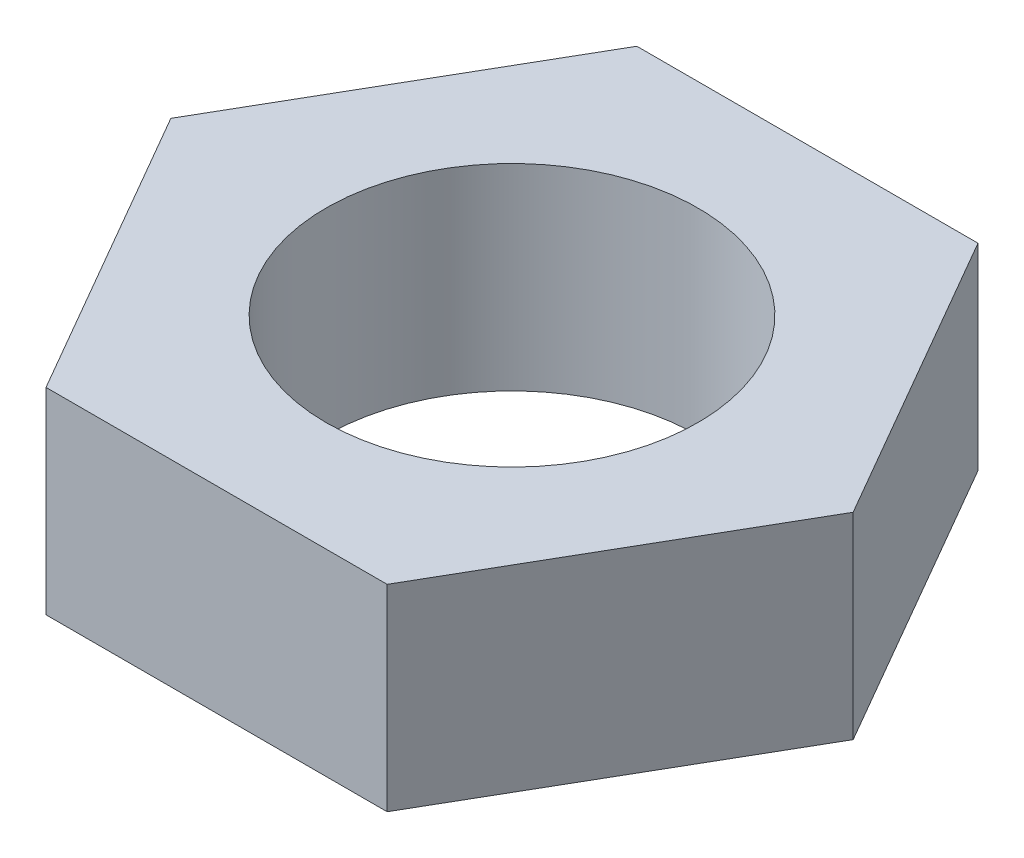
ISO-10303-21;
HEADER;
FILE_DESCRIPTION(('STEP AP214'),'2;1');
FILE_NAME('part.step','',(''),(''),'','','');
FILE_SCHEMA(('AUTOMOTIVE_DESIGN { 1 0 10303 214 1 1 1 1 }'));
ENDSEC;
DATA;
#1=APPLICATION_CONTEXT('core data for automotive mechanical design processes');
#2=APPLICATION_PROTOCOL_DEFINITION('international standard','automotive_design',2000,#1);
#3=PRODUCT_CONTEXT('',#1,'mechanical');
#4=PRODUCT('Part','Part','',(#3));
#5=PRODUCT_RELATED_PRODUCT_CATEGORY('part','',(#4));
#6=PRODUCT_DEFINITION_FORMATION('','',#4);
#7=PRODUCT_DEFINITION_CONTEXT('part definition',#1,'design');
#8=PRODUCT_DEFINITION('design','',#6,#7);
#9=PRODUCT_DEFINITION_SHAPE('','',#8);
#10=(LENGTH_UNIT() NAMED_UNIT(*) SI_UNIT(.MILLI.,.METRE.));
#11=(NAMED_UNIT(*) PLANE_ANGLE_UNIT() SI_UNIT($,.RADIAN.));
#12=(NAMED_UNIT(*) SI_UNIT($,.STERADIAN.) SOLID_ANGLE_UNIT());
#13=UNCERTAINTY_MEASURE_WITH_UNIT(LENGTH_MEASURE(1.E-05),#10,'distance_accuracy_value','');
#14=(GEOMETRIC_REPRESENTATION_CONTEXT(3) GLOBAL_UNCERTAINTY_ASSIGNED_CONTEXT((#13)) GLOBAL_UNIT_ASSIGNED_CONTEXT((#10,
#11,#12)) REPRESENTATION_CONTEXT('',''));
#15=CARTESIAN_POINT('',(0.,0.,0.));
#16=DIRECTION('',(0.,0.,1.));
#17=DIRECTION('',(1.,0.,0.));
#18=AXIS2_PLACEMENT_3D('',#15,#16,#17);
#19=CARTESIAN_POINT('',(1.37481532850781,1.5875,-2.38124999999999));
#20=DIRECTION('',(0.,1.,0.));
#21=DIRECTION('',(0.,0.,1.));
#22=AXIS2_PLACEMENT_3D('',#19,#20,#21);
#23=PLANE('',#22);
#24=DIRECTION('',(-0.499999999999999,0.,-0.866025403784439));
#25=VECTOR('',#24,1.);
#26=CARTESIAN_POINT('',(2.7496306570156,1.5875,0.));
#27=LINE('',#26,#25);
#28=CARTESIAN_POINT('',(2.7496306570156,1.5875,0.));
#29=VERTEX_POINT('',#28);
#30=CARTESIAN_POINT('',(1.37481532850781,1.5875,-2.38124999999999));
#31=VERTEX_POINT('',#30);
#32=EDGE_CURVE('E126',#29,#31,#27,.T.);
#33=ORIENTED_EDGE('',*,*,#32,.T.);
#34=DIRECTION('',(-1.,0.,0.));
#35=VECTOR('',#34,1.);
#36=CARTESIAN_POINT('',(1.37481532850781,1.5875,-2.38124999999999));
#37=LINE('',#36,#35);
#38=CARTESIAN_POINT('',(-1.3748153285078,1.5875,-2.38124999999999));
#39=VERTEX_POINT('',#38);
#40=EDGE_CURVE('E84',#31,#39,#37,.T.);
#41=ORIENTED_EDGE('',*,*,#40,.T.);
#42=DIRECTION('',(-0.5,0.,0.866025403784438));
#43=VECTOR('',#42,1.);
#44=CARTESIAN_POINT('',(-1.3748153285078,1.5875,-2.38124999999999));
#45=LINE('',#44,#43);
#46=CARTESIAN_POINT('',(-2.74963065701559,1.5875,0.));
#47=VERTEX_POINT('',#46);
#48=EDGE_CURVE('E97',#39,#47,#45,.T.);
#49=ORIENTED_EDGE('',*,*,#48,.T.);
#50=DIRECTION('',(0.500000000000001,0.,0.866025403784438));
#51=VECTOR('',#50,1.);
#52=CARTESIAN_POINT('',(-2.74963065701559,1.5875,0.));
#53=LINE('',#52,#51);
#54=CARTESIAN_POINT('',(-1.37481532850779,1.5875,2.38125000000001));
#55=VERTEX_POINT('',#54);
#56=EDGE_CURVE('E91',#47,#55,#53,.T.);
#57=ORIENTED_EDGE('',*,*,#56,.T.);
#58=DIRECTION('',(1.,0.,0.));
#59=VECTOR('',#58,1.);
#60=CARTESIAN_POINT('',(-1.37481532850779,1.5875,2.38125000000001));
#61=LINE('',#60,#59);
#62=CARTESIAN_POINT('',(1.37481532850779,1.5875,2.38125000000001));
#63=VERTEX_POINT('',#62);
#64=EDGE_CURVE('E95',#55,#63,#61,.T.);
#65=ORIENTED_EDGE('',*,*,#64,.T.);
#66=DIRECTION('',(0.500000000000001,0.,-0.866025403784438));
#67=VECTOR('',#66,1.);
#68=CARTESIAN_POINT('',(1.37481532850779,1.5875,2.38125000000001));
#69=LINE('',#68,#67);
#70=EDGE_CURVE('E47',#63,#29,#69,.T.);
#71=ORIENTED_EDGE('',*,*,#70,.T.);
#72=EDGE_LOOP('',(#33,#41,#49,#57,#65,#71));
#73=FACE_BOUND('',#72,.T.);
#74=CARTESIAN_POINT('',(0.,1.5875,0.));
#75=DIRECTION('',(0.,1.,0.));
#76=DIRECTION('',(0.,0.,1.));
#77=AXIS2_PLACEMENT_3D('',#74,#75,#76);
#78=CIRCLE('',#77,1.4986);
#79=CARTESIAN_POINT('',(0.,1.5875,1.4986));
#80=VERTEX_POINT('',#79);
#81=EDGE_CURVE('E119',#80,#80,#78,.T.);
#82=ORIENTED_EDGE('',*,*,#81,.F.);
#83=EDGE_LOOP('',(#82));
#84=FACE_BOUND('',#83,.T.);
#85=ADVANCED_FACE('F30',(#73,#84),#23,.T.);
#86=CARTESIAN_POINT('',(1.37481532850781,0.,-2.38124999999999));
#87=DIRECTION('',(0.,1.,0.));
#88=DIRECTION('',(0.,0.,1.));
#89=AXIS2_PLACEMENT_3D('',#86,#87,#88);
#90=PLANE('',#89);
#91=DIRECTION('',(-0.499999999999999,0.,-0.866025403784439));
#92=VECTOR('',#91,1.);
#93=CARTESIAN_POINT('',(2.7496306570156,0.,0.));
#94=LINE('',#93,#92);
#95=CARTESIAN_POINT('',(2.7496306570156,0.,0.));
#96=VERTEX_POINT('',#95);
#97=CARTESIAN_POINT('',(1.37481532850781,0.,-2.38124999999999));
#98=VERTEX_POINT('',#97);
#99=EDGE_CURVE('E115',#96,#98,#94,.T.);
#100=ORIENTED_EDGE('',*,*,#99,.F.);
#101=DIRECTION('',(0.500000000000001,0.,-0.866025403784438));
#102=VECTOR('',#101,1.);
#103=CARTESIAN_POINT('',(1.37481532850779,0.,2.38125000000001));
#104=LINE('',#103,#102);
#105=CARTESIAN_POINT('',(1.37481532850779,0.,2.38125000000001));
#106=VERTEX_POINT('',#105);
#107=EDGE_CURVE('E76',#106,#96,#104,.T.);
#108=ORIENTED_EDGE('',*,*,#107,.F.);
#109=DIRECTION('',(1.,0.,0.));
#110=VECTOR('',#109,1.);
#111=CARTESIAN_POINT('',(-1.37481532850779,0.,2.38125000000001));
#112=LINE('',#111,#110);
#113=CARTESIAN_POINT('',(-1.37481532850779,0.,2.38125000000001));
#114=VERTEX_POINT('',#113);
#115=EDGE_CURVE('E70',#114,#106,#112,.T.);
#116=ORIENTED_EDGE('',*,*,#115,.F.);
#117=DIRECTION('',(0.500000000000001,0.,0.866025403784438));
#118=VECTOR('',#117,1.);
#119=CARTESIAN_POINT('',(-2.74963065701559,0.,0.));
#120=LINE('',#119,#118);
#121=CARTESIAN_POINT('',(-2.74963065701559,0.,0.));
#122=VERTEX_POINT('',#121);
#123=EDGE_CURVE('E105',#122,#114,#120,.T.);
#124=ORIENTED_EDGE('',*,*,#123,.F.);
#125=DIRECTION('',(-0.5,0.,0.866025403784438));
#126=VECTOR('',#125,1.);
#127=CARTESIAN_POINT('',(-1.3748153285078,0.,-2.38124999999999));
#128=LINE('',#127,#126);
#129=CARTESIAN_POINT('',(-1.3748153285078,0.,-2.38124999999999));
#130=VERTEX_POINT('',#129);
#131=EDGE_CURVE('E121',#130,#122,#128,.T.);
#132=ORIENTED_EDGE('',*,*,#131,.F.);
#133=DIRECTION('',(-1.,0.,0.));
#134=VECTOR('',#133,1.);
#135=CARTESIAN_POINT('',(1.37481532850781,0.,-2.38124999999999));
#136=LINE('',#135,#134);
#137=EDGE_CURVE('E118',#98,#130,#136,.T.);
#138=ORIENTED_EDGE('',*,*,#137,.F.);
#139=EDGE_LOOP('',(#100,#108,#116,#124,#132,#138));
#140=FACE_BOUND('',#139,.T.);
#141=CARTESIAN_POINT('',(0.,0.,0.));
#142=DIRECTION('',(0.,1.,0.));
#143=DIRECTION('',(0.,0.,1.));
#144=AXIS2_PLACEMENT_3D('',#141,#142,#143);
#145=CIRCLE('',#144,1.4986);
#146=CARTESIAN_POINT('',(0.,0.,1.4986));
#147=VERTEX_POINT('',#146);
#148=EDGE_CURVE('E219',#147,#147,#145,.T.);
#149=ORIENTED_EDGE('',*,*,#148,.T.);
#150=EDGE_LOOP('',(#149));
#151=FACE_BOUND('',#150,.T.);
#152=ADVANCED_FACE('F135',(#140,#151),#90,.F.);
#153=CARTESIAN_POINT('',(2.7496306570156,1.5875,0.));
#154=DIRECTION('',(-0.866025403784439,0.,0.5));
#155=DIRECTION('',(0.499999999999999,0.,0.866025403784439));
#156=AXIS2_PLACEMENT_3D('',#153,#154,#155);
#157=PLANE('',#156);
#158=ORIENTED_EDGE('',*,*,#99,.T.);
#159=DIRECTION('',(0.,-1.,0.));
#160=VECTOR('',#159,1.);
#161=CARTESIAN_POINT('',(1.37481532850781,1.5875,-2.38124999999999));
#162=LINE('',#161,#160);
#163=EDGE_CURVE('E11',#31,#98,#162,.T.);
#164=ORIENTED_EDGE('',*,*,#163,.F.);
#165=ORIENTED_EDGE('',*,*,#32,.F.);
#166=DIRECTION('',(0.,-1.,0.));
#167=VECTOR('',#166,1.);
#168=CARTESIAN_POINT('',(2.7496306570156,1.5875,0.));
#169=LINE('',#168,#167);
#170=EDGE_CURVE('E111',#29,#96,#169,.T.);
#171=ORIENTED_EDGE('',*,*,#170,.T.);
#172=EDGE_LOOP('',(#158,#164,#165,#171));
#173=FACE_BOUND('',#172,.T.);
#174=ADVANCED_FACE('F32',(#173),#157,.F.);
#175=CARTESIAN_POINT('',(1.37481532850781,1.5875,-2.38124999999999));
#176=DIRECTION('',(0.,0.,1.));
#177=DIRECTION('',(1.,0.,0.));
#178=AXIS2_PLACEMENT_3D('',#175,#176,#177);
#179=PLANE('',#178);
#180=ORIENTED_EDGE('',*,*,#137,.T.);
#181=DIRECTION('',(0.,-1.,0.));
#182=VECTOR('',#181,1.);
#183=CARTESIAN_POINT('',(-1.3748153285078,1.5875,-2.38124999999999));
#184=LINE('',#183,#182);
#185=EDGE_CURVE('E39',#39,#130,#184,.T.);
#186=ORIENTED_EDGE('',*,*,#185,.F.);
#187=ORIENTED_EDGE('',*,*,#40,.F.);
#188=ORIENTED_EDGE('',*,*,#163,.T.);
#189=EDGE_LOOP('',(#180,#186,#187,#188));
#190=FACE_BOUND('',#189,.T.);
#191=ADVANCED_FACE('F160',(#190),#179,.F.);
#192=CARTESIAN_POINT('',(-1.3748153285078,1.5875,-2.38124999999999));
#193=DIRECTION('',(0.866025403784438,0.,0.5));
#194=DIRECTION('',(0.5,0.,-0.866025403784438));
#195=AXIS2_PLACEMENT_3D('',#192,#193,#194);
#196=PLANE('',#195);
#197=ORIENTED_EDGE('',*,*,#131,.T.);
#198=DIRECTION('',(0.,-1.,0.));
#199=VECTOR('',#198,1.);
#200=CARTESIAN_POINT('',(-2.74963065701559,1.5875,0.));
#201=LINE('',#200,#199);
#202=EDGE_CURVE('E106',#47,#122,#201,.T.);
#203=ORIENTED_EDGE('',*,*,#202,.F.);
#204=ORIENTED_EDGE('',*,*,#48,.F.);
#205=ORIENTED_EDGE('',*,*,#185,.T.);
#206=EDGE_LOOP('',(#197,#203,#204,#205));
#207=FACE_BOUND('',#206,.T.);
#208=ADVANCED_FACE('F132',(#207),#196,.F.);
#209=CARTESIAN_POINT('',(-2.74963065701559,1.5875,0.));
#210=DIRECTION('',(0.866025403784438,0.,-0.500000000000001));
#211=DIRECTION('',(-0.500000000000001,0.,-0.866025403784438));
#212=AXIS2_PLACEMENT_3D('',#209,#210,#211);
#213=PLANE('',#212);
#214=ORIENTED_EDGE('',*,*,#123,.T.);
#215=DIRECTION('',(0.,-1.,0.));
#216=VECTOR('',#215,1.);
#217=CARTESIAN_POINT('',(-1.37481532850779,1.5875,2.38125000000001));
#218=LINE('',#217,#216);
#219=EDGE_CURVE('E102',#55,#114,#218,.T.);
#220=ORIENTED_EDGE('',*,*,#219,.F.);
#221=ORIENTED_EDGE('',*,*,#56,.F.);
#222=ORIENTED_EDGE('',*,*,#202,.T.);
#223=EDGE_LOOP('',(#214,#220,#221,#222));
#224=FACE_BOUND('',#223,.T.);
#225=ADVANCED_FACE('F103',(#224),#213,.F.);
#226=CARTESIAN_POINT('',(-1.37481532850779,1.5875,2.38125000000001));
#227=DIRECTION('',(0.,0.,-1.));
#228=DIRECTION('',(-1.,0.,0.));
#229=AXIS2_PLACEMENT_3D('',#226,#227,#228);
#230=PLANE('',#229);
#231=ORIENTED_EDGE('',*,*,#115,.T.);
#232=DIRECTION('',(0.,-1.,0.));
#233=VECTOR('',#232,1.);
#234=CARTESIAN_POINT('',(1.37481532850779,1.5875,2.38125000000001));
#235=LINE('',#234,#233);
#236=EDGE_CURVE('E107',#63,#106,#235,.T.);
#237=ORIENTED_EDGE('',*,*,#236,.F.);
#238=ORIENTED_EDGE('',*,*,#64,.F.);
#239=ORIENTED_EDGE('',*,*,#219,.T.);
#240=EDGE_LOOP('',(#231,#237,#238,#239));
#241=FACE_BOUND('',#240,.T.);
#242=ADVANCED_FACE('F109',(#241),#230,.F.);
#243=CARTESIAN_POINT('',(1.37481532850779,1.5875,2.38125000000001));
#244=DIRECTION('',(-0.866025403784438,0.,-0.500000000000001));
#245=DIRECTION('',(-0.500000000000001,0.,0.866025403784438));
#246=AXIS2_PLACEMENT_3D('',#243,#244,#245);
#247=PLANE('',#246);
#248=ORIENTED_EDGE('',*,*,#107,.T.);
#249=ORIENTED_EDGE('',*,*,#170,.F.);
#250=ORIENTED_EDGE('',*,*,#70,.F.);
#251=ORIENTED_EDGE('',*,*,#236,.T.);
#252=EDGE_LOOP('',(#248,#249,#250,#251));
#253=FACE_BOUND('',#252,.T.);
#254=ADVANCED_FACE('F140',(#253),#247,.F.);
#255=CARTESIAN_POINT('',(0.,1.5875,0.));
#256=DIRECTION('',(0.,-1.,0.));
#257=DIRECTION('',(0.,0.,-1.));
#258=AXIS2_PLACEMENT_3D('',#255,#256,#257);
#259=CYLINDRICAL_SURFACE('',#258,1.4986);
#260=ORIENTED_EDGE('',*,*,#81,.T.);
#261=EDGE_LOOP('',(#260));
#262=FACE_BOUND('',#261,.T.);
#263=ORIENTED_EDGE('',*,*,#148,.F.);
#264=EDGE_LOOP('',(#263));
#265=FACE_BOUND('',#264,.T.);
#266=ADVANCED_FACE('F142',(#262,#265),#259,.F.);
#267=CLOSED_SHELL('',(#85,#152,#174,#191,#208,#225,#242,#254,#266));
#268=MANIFOLD_SOLID_BREP('B2',#267);
#269=ADVANCED_BREP_SHAPE_REPRESENTATION('',(#18,#268),#14);
#270=SHAPE_DEFINITION_REPRESENTATION(#9,#269);
ENDSEC;
END-ISO-10303-21;
